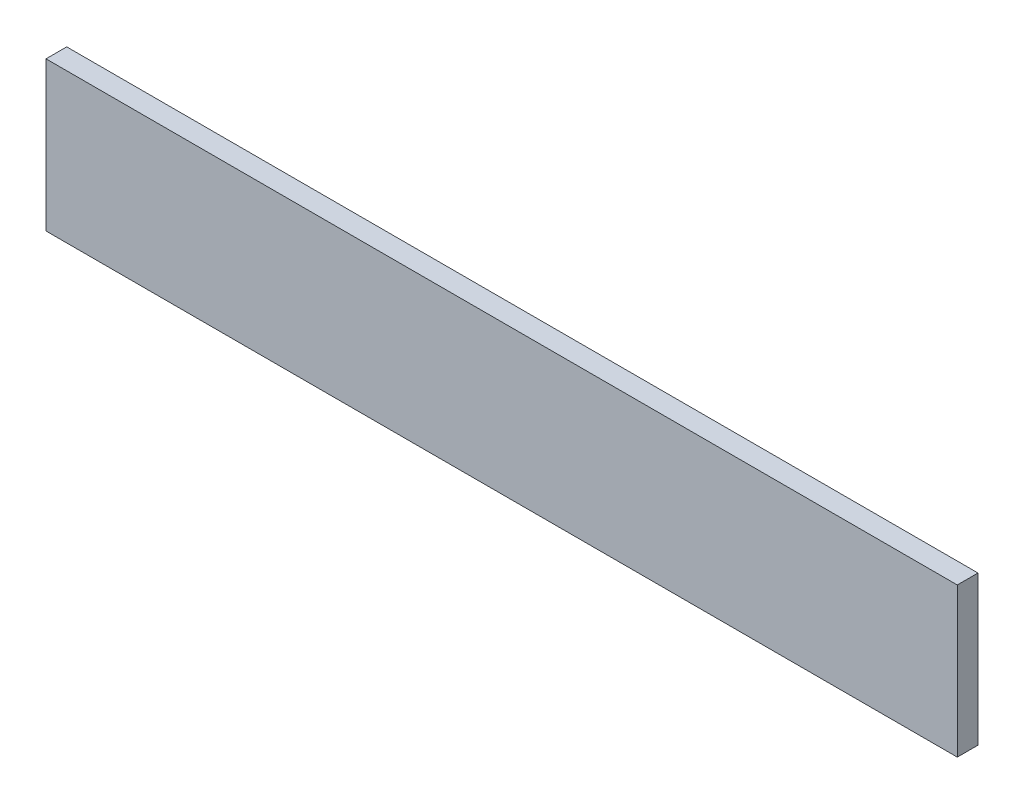
ISO-10303-21;
HEADER;
FILE_DESCRIPTION(('STEP AP214'),'2;1');
FILE_NAME('part.step','',(''),(''),'','','');
FILE_SCHEMA(('AUTOMOTIVE_DESIGN { 1 0 10303 214 1 1 1 1 }'));
ENDSEC;
DATA;
#1=APPLICATION_CONTEXT('core data for automotive mechanical design processes');
#2=APPLICATION_PROTOCOL_DEFINITION('international standard','automotive_design',2000,#1);
#3=PRODUCT_CONTEXT('',#1,'mechanical');
#4=PRODUCT('Part','Part','',(#3));
#5=PRODUCT_RELATED_PRODUCT_CATEGORY('part','',(#4));
#6=PRODUCT_DEFINITION_FORMATION('','',#4);
#7=PRODUCT_DEFINITION_CONTEXT('part definition',#1,'design');
#8=PRODUCT_DEFINITION('design','',#6,#7);
#9=PRODUCT_DEFINITION_SHAPE('','',#8);
#10=(LENGTH_UNIT() NAMED_UNIT(*) SI_UNIT(.MILLI.,.METRE.));
#11=(NAMED_UNIT(*) PLANE_ANGLE_UNIT() SI_UNIT($,.RADIAN.));
#12=(NAMED_UNIT(*) SI_UNIT($,.STERADIAN.) SOLID_ANGLE_UNIT());
#13=UNCERTAINTY_MEASURE_WITH_UNIT(LENGTH_MEASURE(1.E-05),#10,'distance_accuracy_value','');
#14=(GEOMETRIC_REPRESENTATION_CONTEXT(3) GLOBAL_UNCERTAINTY_ASSIGNED_CONTEXT((#13)) GLOBAL_UNIT_ASSIGNED_CONTEXT((#10,
#11,#12)) REPRESENTATION_CONTEXT('',''));
#15=CARTESIAN_POINT('',(0.,0.,0.));
#16=DIRECTION('',(0.,0.,1.));
#17=DIRECTION('',(1.,0.,0.));
#18=AXIS2_PLACEMENT_3D('',#15,#16,#17);
#19=CARTESIAN_POINT('',(69.85,-11.43,1.5875));
#20=DIRECTION('',(-1.,0.,0.));
#21=DIRECTION('',(0.,0.,1.));
#22=AXIS2_PLACEMENT_3D('',#19,#20,#21);
#23=PLANE('',#22);
#24=DIRECTION('',(0.,1.,0.));
#25=VECTOR('',#24,1.);
#26=CARTESIAN_POINT('',(69.85,-11.43,-1.5875));
#27=LINE('',#26,#25);
#28=CARTESIAN_POINT('',(69.85,-11.43,-1.5875));
#29=VERTEX_POINT('',#28);
#30=CARTESIAN_POINT('',(69.85,11.43,-1.5875));
#31=VERTEX_POINT('',#30);
#32=EDGE_CURVE('E107',#29,#31,#27,.T.);
#33=ORIENTED_EDGE('',*,*,#32,.T.);
#34=DIRECTION('',(0.,0.,-1.));
#35=VECTOR('',#34,1.);
#36=CARTESIAN_POINT('',(69.85,11.43,1.5875));
#37=LINE('',#36,#35);
#38=CARTESIAN_POINT('',(69.85,11.43,1.5875));
#39=VERTEX_POINT('',#38);
#40=EDGE_CURVE('E11',#39,#31,#37,.T.);
#41=ORIENTED_EDGE('',*,*,#40,.F.);
#42=DIRECTION('',(0.,1.,0.));
#43=VECTOR('',#42,1.);
#44=CARTESIAN_POINT('',(69.85,-11.43,1.5875));
#45=LINE('',#44,#43);
#46=CARTESIAN_POINT('',(69.85,-11.43,1.5875));
#47=VERTEX_POINT('',#46);
#48=EDGE_CURVE('E91',#47,#39,#45,.T.);
#49=ORIENTED_EDGE('',*,*,#48,.F.);
#50=DIRECTION('',(0.,0.,-1.));
#51=VECTOR('',#50,1.);
#52=CARTESIAN_POINT('',(69.85,-11.43,1.5875));
#53=LINE('',#52,#51);
#54=EDGE_CURVE('E103',#47,#29,#53,.T.);
#55=ORIENTED_EDGE('',*,*,#54,.T.);
#56=EDGE_LOOP('',(#33,#41,#49,#55));
#57=FACE_BOUND('',#56,.T.);
#58=ADVANCED_FACE('F39',(#57),#23,.F.);
#59=CARTESIAN_POINT('',(-69.85,11.43,1.5875));
#60=DIRECTION('',(0.,-1.,0.));
#61=DIRECTION('',(0.,0.,-1.));
#62=AXIS2_PLACEMENT_3D('',#59,#60,#61);
#63=PLANE('',#62);
#64=DIRECTION('',(-1.,0.,0.));
#65=VECTOR('',#64,1.);
#66=CARTESIAN_POINT('',(-69.85,11.43,-1.5875));
#67=LINE('',#66,#65);
#68=CARTESIAN_POINT('',(-69.85,11.43,-1.5875));
#69=VERTEX_POINT('',#68);
#70=EDGE_CURVE('E96',#31,#69,#67,.T.);
#71=ORIENTED_EDGE('',*,*,#70,.T.);
#72=DIRECTION('',(0.,0.,-1.));
#73=VECTOR('',#72,1.);
#74=CARTESIAN_POINT('',(-69.85,11.43,1.5875));
#75=LINE('',#74,#73);
#76=CARTESIAN_POINT('',(-69.85,11.43,1.5875));
#77=VERTEX_POINT('',#76);
#78=EDGE_CURVE('E48',#77,#69,#75,.T.);
#79=ORIENTED_EDGE('',*,*,#78,.F.);
#80=DIRECTION('',(-1.,0.,0.));
#81=VECTOR('',#80,1.);
#82=CARTESIAN_POINT('',(-69.85,11.43,1.5875));
#83=LINE('',#82,#81);
#84=EDGE_CURVE('E86',#39,#77,#83,.T.);
#85=ORIENTED_EDGE('',*,*,#84,.F.);
#86=ORIENTED_EDGE('',*,*,#40,.T.);
#87=EDGE_LOOP('',(#71,#79,#85,#86));
#88=FACE_BOUND('',#87,.T.);
#89=ADVANCED_FACE('F95',(#88),#63,.F.);
#90=CARTESIAN_POINT('',(-69.85,-11.43,1.5875));
#91=DIRECTION('',(1.,0.,0.));
#92=DIRECTION('',(0.,0.,-1.));
#93=AXIS2_PLACEMENT_3D('',#90,#91,#92);
#94=PLANE('',#93);
#95=DIRECTION('',(0.,-1.,0.));
#96=VECTOR('',#95,1.);
#97=CARTESIAN_POINT('',(-69.85,-11.43,-1.5875));
#98=LINE('',#97,#96);
#99=CARTESIAN_POINT('',(-69.85,-11.43,-1.5875));
#100=VERTEX_POINT('',#99);
#101=EDGE_CURVE('E73',#69,#100,#98,.T.);
#102=ORIENTED_EDGE('',*,*,#101,.T.);
#103=DIRECTION('',(0.,0.,-1.));
#104=VECTOR('',#103,1.);
#105=CARTESIAN_POINT('',(-69.85,-11.43,1.5875));
#106=LINE('',#105,#104);
#107=CARTESIAN_POINT('',(-69.85,-11.43,1.5875));
#108=VERTEX_POINT('',#107);
#109=EDGE_CURVE('E98',#108,#100,#106,.T.);
#110=ORIENTED_EDGE('',*,*,#109,.F.);
#111=DIRECTION('',(0.,-1.,0.));
#112=VECTOR('',#111,1.);
#113=CARTESIAN_POINT('',(-69.85,-11.43,1.5875));
#114=LINE('',#113,#112);
#115=EDGE_CURVE('E89',#77,#108,#114,.T.);
#116=ORIENTED_EDGE('',*,*,#115,.F.);
#117=ORIENTED_EDGE('',*,*,#78,.T.);
#118=EDGE_LOOP('',(#102,#110,#116,#117));
#119=FACE_BOUND('',#118,.T.);
#120=ADVANCED_FACE('F99',(#119),#94,.F.);
#121=CARTESIAN_POINT('',(-69.85,-11.43,1.5875));
#122=DIRECTION('',(0.,1.,0.));
#123=DIRECTION('',(0.,0.,1.));
#124=AXIS2_PLACEMENT_3D('',#121,#122,#123);
#125=PLANE('',#124);
#126=DIRECTION('',(1.,0.,0.));
#127=VECTOR('',#126,1.);
#128=CARTESIAN_POINT('',(-69.85,-11.43,-1.5875));
#129=LINE('',#128,#127);
#130=EDGE_CURVE('E79',#100,#29,#129,.T.);
#131=ORIENTED_EDGE('',*,*,#130,.T.);
#132=ORIENTED_EDGE('',*,*,#54,.F.);
#133=DIRECTION('',(1.,0.,0.));
#134=VECTOR('',#133,1.);
#135=CARTESIAN_POINT('',(-69.85,-11.43,1.5875));
#136=LINE('',#135,#134);
#137=EDGE_CURVE('E56',#108,#47,#136,.T.);
#138=ORIENTED_EDGE('',*,*,#137,.F.);
#139=ORIENTED_EDGE('',*,*,#109,.T.);
#140=EDGE_LOOP('',(#131,#132,#138,#139));
#141=FACE_BOUND('',#140,.T.);
#142=ADVANCED_FACE('F120',(#141),#125,.F.);
#143=CARTESIAN_POINT('',(0.,0.,1.5875));
#144=DIRECTION('',(0.,0.,-1.));
#145=DIRECTION('',(-1.,0.,0.));
#146=AXIS2_PLACEMENT_3D('',#143,#144,#145);
#147=PLANE('',#146);
#148=ORIENTED_EDGE('',*,*,#48,.T.);
#149=ORIENTED_EDGE('',*,*,#84,.T.);
#150=ORIENTED_EDGE('',*,*,#115,.T.);
#151=ORIENTED_EDGE('',*,*,#137,.T.);
#152=EDGE_LOOP('',(#148,#149,#150,#151));
#153=FACE_BOUND('',#152,.T.);
#154=ADVANCED_FACE('F87',(#153),#147,.F.);
#155=CARTESIAN_POINT('',(0.,0.,-1.5875));
#156=DIRECTION('',(0.,0.,-1.));
#157=DIRECTION('',(-1.,0.,0.));
#158=AXIS2_PLACEMENT_3D('',#155,#156,#157);
#159=PLANE('',#158);
#160=ORIENTED_EDGE('',*,*,#32,.F.);
#161=ORIENTED_EDGE('',*,*,#130,.F.);
#162=ORIENTED_EDGE('',*,*,#101,.F.);
#163=ORIENTED_EDGE('',*,*,#70,.F.);
#164=EDGE_LOOP('',(#160,#161,#162,#163));
#165=FACE_BOUND('',#164,.T.);
#166=ADVANCED_FACE('F123',(#165),#159,.T.);
#167=CLOSED_SHELL('',(#58,#89,#120,#142,#154,#166));
#168=MANIFOLD_SOLID_BREP('B2',#167);
#169=ADVANCED_BREP_SHAPE_REPRESENTATION('',(#18,#168),#14);
#170=SHAPE_DEFINITION_REPRESENTATION(#9,#169);
ENDSEC;
END-ISO-10303-21;
